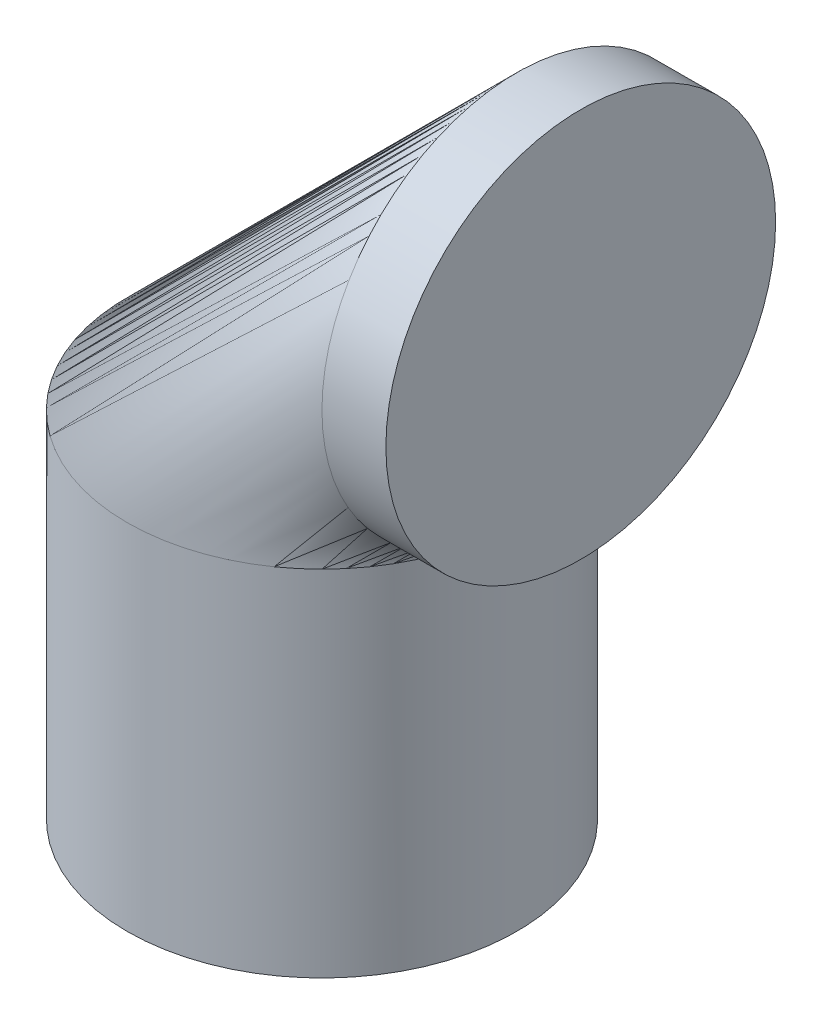
ISO-10303-21;
HEADER;
FILE_DESCRIPTION(('STEP AP214'),'2;1');
FILE_NAME('part.step','',(''),(''),'','','');
FILE_SCHEMA(('AUTOMOTIVE_DESIGN { 1 0 10303 214 1 1 1 1 }'));
ENDSEC;
DATA;
#1=APPLICATION_CONTEXT('core data for automotive mechanical design processes');
#2=APPLICATION_PROTOCOL_DEFINITION('international standard','automotive_design',2000,#1);
#3=PRODUCT_CONTEXT('',#1,'mechanical');
#4=PRODUCT('Part','Part','',(#3));
#5=PRODUCT_RELATED_PRODUCT_CATEGORY('part','',(#4));
#6=PRODUCT_DEFINITION_FORMATION('','',#4);
#7=PRODUCT_DEFINITION_CONTEXT('part definition',#1,'design');
#8=PRODUCT_DEFINITION('design','',#6,#7);
#9=PRODUCT_DEFINITION_SHAPE('','',#8);
#10=(LENGTH_UNIT() NAMED_UNIT(*) SI_UNIT(.MILLI.,.METRE.));
#11=(NAMED_UNIT(*) PLANE_ANGLE_UNIT() SI_UNIT($,.RADIAN.));
#12=(NAMED_UNIT(*) SI_UNIT($,.STERADIAN.) SOLID_ANGLE_UNIT());
#13=UNCERTAINTY_MEASURE_WITH_UNIT(LENGTH_MEASURE(1.E-05),#10,'distance_accuracy_value','');
#14=(GEOMETRIC_REPRESENTATION_CONTEXT(3) GLOBAL_UNCERTAINTY_ASSIGNED_CONTEXT((#13)) GLOBAL_UNIT_ASSIGNED_CONTEXT((#10,
#11,#12)) REPRESENTATION_CONTEXT('',''));
#15=CARTESIAN_POINT('',(0.,0.,0.));
#16=DIRECTION('',(0.,0.,1.));
#17=DIRECTION('',(1.,0.,0.));
#18=AXIS2_PLACEMENT_3D('',#15,#16,#17);
#19=CARTESIAN_POINT('',(0.,0.,0.));
#20=DIRECTION('',(0.,1.,0.));
#21=DIRECTION('',(0.,0.,1.));
#22=AXIS2_PLACEMENT_3D('',#19,#20,#21);
#23=PLANE('',#22);
#24=CARTESIAN_POINT('',(0.,0.,0.));
#25=DIRECTION('',(0.,1.,0.));
#26=DIRECTION('',(0.,0.,1.));
#27=AXIS2_PLACEMENT_3D('',#24,#25,#26);
#28=CIRCLE('',#27,25.);
#29=CARTESIAN_POINT('',(0.,0.,25.));
#30=VERTEX_POINT('',#29);
#31=EDGE_CURVE('E64',#30,#30,#28,.T.);
#32=ORIENTED_EDGE('',*,*,#31,.F.);
#33=EDGE_LOOP('',(#32));
#34=FACE_BOUND('',#33,.T.);
#35=ADVANCED_FACE('F46',(#34),#23,.F.);
#36=CARTESIAN_POINT('',(33.2,70.42,0.));
#37=DIRECTION('',(1.,0.,0.));
#38=DIRECTION('',(0.,0.,1.));
#39=AXIS2_PLACEMENT_3D('',#36,#37,#38);
#40=PLANE('',#39);
#41=CARTESIAN_POINT('',(33.2,70.42,0.));
#42=DIRECTION('',(1.,0.,0.));
#43=DIRECTION('',(0.,0.,1.));
#44=AXIS2_PLACEMENT_3D('',#41,#42,#43);
#45=CIRCLE('',#44,25.);
#46=CARTESIAN_POINT('',(33.2,70.42,25.));
#47=VERTEX_POINT('',#46);
#48=EDGE_CURVE('E11',#47,#47,#45,.T.);
#49=ORIENTED_EDGE('',*,*,#48,.T.);
#50=EDGE_LOOP('',(#49));
#51=FACE_BOUND('',#50,.T.);
#52=ADVANCED_FACE('F75',(#51),#40,.T.);
#53=CARTESIAN_POINT('',(0.,0.,0.));
#54=DIRECTION('',(0.,1.,0.));
#55=DIRECTION('',(-1.,0.,0.));
#56=AXIS2_PLACEMENT_3D('',#53,#54,#55);
#57=CYLINDRICAL_SURFACE('',#56,25.);
#58=CARTESIAN_POINT('',(0.,45.42,0.));
#59=DIRECTION('',(0.,1.,0.));
#60=DIRECTION('',(0.,0.,1.));
#61=AXIS2_PLACEMENT_3D('',#58,#59,#60);
#62=CIRCLE('',#61,25.);
#63=CARTESIAN_POINT('',(25.,45.42,0.));
#64=VERTEX_POINT('',#63);
#65=EDGE_CURVE('E57',#64,#64,#62,.T.);
#66=ORIENTED_EDGE('',*,*,#65,.F.);
#67=EDGE_LOOP('',(#66));
#68=FACE_BOUND('',#67,.T.);
#69=ORIENTED_EDGE('',*,*,#31,.T.);
#70=EDGE_LOOP('',(#69));
#71=FACE_BOUND('',#70,.T.);
#72=ADVANCED_FACE('F58',(#68,#71),#57,.T.);
#73=CARTESIAN_POINT('',(25.,45.42,0.));
#74=DIRECTION('',(0.,0.,-1.));
#75=DIRECTION('',(-1.,0.,0.));
#76=AXIS2_PLACEMENT_3D('',#73,#74,#75);
#77=TOROIDAL_SURFACE('',#76,25.,25.);
#78=CARTESIAN_POINT('',(25.,70.42,0.));
#79=DIRECTION('',(1.,0.,0.));
#80=DIRECTION('',(0.,0.,1.));
#81=AXIS2_PLACEMENT_3D('',#78,#79,#80);
#82=CIRCLE('',#81,25.);
#83=EDGE_CURVE('E53',#64,#64,#82,.T.);
#84=ORIENTED_EDGE('',*,*,#83,.F.);
#85=ORIENTED_EDGE('',*,*,#65,.T.);
#86=EDGE_LOOP('',(#84,#85));
#87=FACE_BOUND('',#86,.T.);
#88=ADVANCED_FACE('F82',(#87),#77,.T.);
#89=CARTESIAN_POINT('',(25.,70.42,0.));
#90=DIRECTION('',(1.,0.,0.));
#91=DIRECTION('',(0.,1.,0.));
#92=AXIS2_PLACEMENT_3D('',#89,#90,#91);
#93=CYLINDRICAL_SURFACE('',#92,25.);
#94=ORIENTED_EDGE('',*,*,#48,.F.);
#95=EDGE_LOOP('',(#94));
#96=FACE_BOUND('',#95,.T.);
#97=ORIENTED_EDGE('',*,*,#83,.T.);
#98=EDGE_LOOP('',(#97));
#99=FACE_BOUND('',#98,.T.);
#100=ADVANCED_FACE('F80',(#96,#99),#93,.T.);
#101=CLOSED_SHELL('',(#35,#52,#72,#88,#100));
#102=MANIFOLD_SOLID_BREP('B2',#101);
#103=ADVANCED_BREP_SHAPE_REPRESENTATION('',(#18,#102),#14);
#104=SHAPE_DEFINITION_REPRESENTATION(#9,#103);
ENDSEC;
END-ISO-10303-21;
